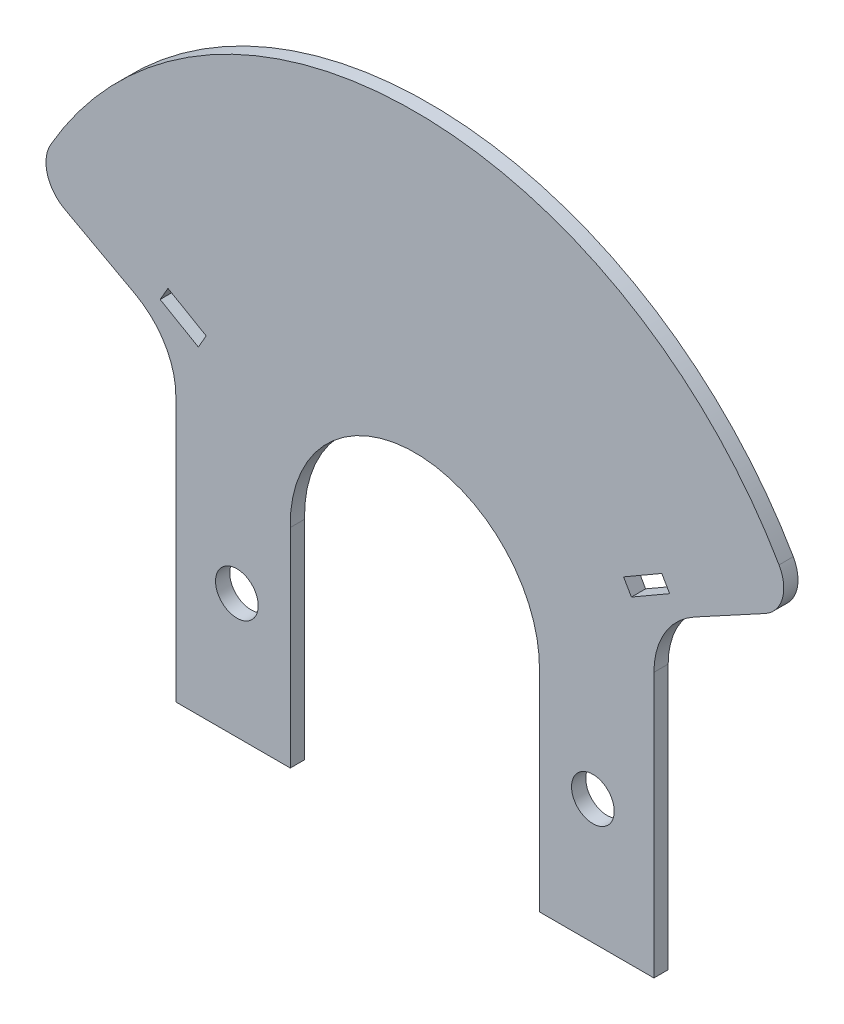
ISO-10303-21;
HEADER;
FILE_DESCRIPTION(('STEP AP214'),'2;1');
FILE_NAME('part.step','',(''),(''),'','','');
FILE_SCHEMA(('AUTOMOTIVE_DESIGN { 1 0 10303 214 1 1 1 1 }'));
ENDSEC;
DATA;
#1=APPLICATION_CONTEXT('core data for automotive mechanical design processes');
#2=APPLICATION_PROTOCOL_DEFINITION('international standard','automotive_design',2000,#1);
#3=PRODUCT_CONTEXT('',#1,'mechanical');
#4=PRODUCT('Part','Part','',(#3));
#5=PRODUCT_RELATED_PRODUCT_CATEGORY('part','',(#4));
#6=PRODUCT_DEFINITION_FORMATION('','',#4);
#7=PRODUCT_DEFINITION_CONTEXT('part definition',#1,'design');
#8=PRODUCT_DEFINITION('design','',#6,#7);
#9=PRODUCT_DEFINITION_SHAPE('','',#8);
#10=(LENGTH_UNIT() NAMED_UNIT(*) SI_UNIT(.MILLI.,.METRE.));
#11=(NAMED_UNIT(*) PLANE_ANGLE_UNIT() SI_UNIT($,.RADIAN.));
#12=(NAMED_UNIT(*) SI_UNIT($,.STERADIAN.) SOLID_ANGLE_UNIT());
#13=UNCERTAINTY_MEASURE_WITH_UNIT(LENGTH_MEASURE(1.E-05),#10,'distance_accuracy_value','');
#14=(GEOMETRIC_REPRESENTATION_CONTEXT(3) GLOBAL_UNCERTAINTY_ASSIGNED_CONTEXT((#13)) GLOBAL_UNIT_ASSIGNED_CONTEXT((#10,
#11,#12)) REPRESENTATION_CONTEXT('',''));
#15=CARTESIAN_POINT('',(0.,0.,0.));
#16=DIRECTION('',(0.,0.,1.));
#17=DIRECTION('',(1.,0.,0.));
#18=AXIS2_PLACEMENT_3D('',#15,#16,#17);
#19=CARTESIAN_POINT('',(44.466141388621,7.19165286363918,2.));
#20=DIRECTION('',(0.,0.,-1.));
#21=DIRECTION('',(-1.,0.,0.));
#22=AXIS2_PLACEMENT_3D('',#19,#20,#21);
#23=PLANE('',#22);
#24=DIRECTION('',(-0.5,-0.866025403784439,0.));
#25=VECTOR('',#24,1.);
#26=CARTESIAN_POINT('',(-34.6776186916967,19.7706159536035,2.));
#27=LINE('',#26,#25);
#28=CARTESIAN_POINT('',(-34.6776186916967,19.7706159536035,2.));
#29=VERTEX_POINT('',#28);
#30=CARTESIAN_POINT('',(-35.7776186916967,17.8653600652777,2.));
#31=VERTEX_POINT('',#30);
#32=EDGE_CURVE('E225',#29,#31,#27,.T.);
#33=ORIENTED_EDGE('',*,*,#32,.F.);
#34=DIRECTION('',(-0.866025403784439,0.499999999999999,0.));
#35=VECTOR('',#34,1.);
#36=CARTESIAN_POINT('',(-29.3082611882331,16.6706159536035,2.));
#37=LINE('',#36,#35);
#38=CARTESIAN_POINT('',(-29.3082611882331,16.6706159536035,2.));
#39=VERTEX_POINT('',#38);
#40=EDGE_CURVE('E233',#39,#29,#37,.T.);
#41=ORIENTED_EDGE('',*,*,#40,.F.);
#42=DIRECTION('',(0.5,0.866025403784438,0.));
#43=VECTOR('',#42,1.);
#44=CARTESIAN_POINT('',(-30.4082611882331,14.7653600652777,2.));
#45=LINE('',#44,#43);
#46=CARTESIAN_POINT('',(-30.4082611882331,14.7653600652777,2.));
#47=VERTEX_POINT('',#46);
#48=EDGE_CURVE('E230',#47,#39,#45,.T.);
#49=ORIENTED_EDGE('',*,*,#48,.F.);
#50=DIRECTION('',(0.866025403784439,-0.5,0.));
#51=VECTOR('',#50,1.);
#52=CARTESIAN_POINT('',(-35.7776186916967,17.8653600652777,2.));
#53=LINE('',#52,#51);
#54=EDGE_CURVE('E227',#31,#47,#53,.T.);
#55=ORIENTED_EDGE('',*,*,#54,.F.);
#56=EDGE_LOOP('',(#33,#41,#49,#55));
#57=FACE_BOUND('',#56,.T.);
#58=CARTESIAN_POINT('',(0.,-0.365986586774891,2.));
#59=DIRECTION('',(0.,0.,1.));
#60=DIRECTION('',(1.,0.,0.));
#61=AXIS2_PLACEMENT_3D('',#58,#59,#60);
#62=CIRCLE('',#61,58.993839611708);
#63=CARTESIAN_POINT('',(51.1418153623544,29.0412885942884,2.));
#64=VERTEX_POINT('',#63);
#65=CARTESIAN_POINT('',(-51.1418153623544,29.0412885942884,2.));
#66=VERTEX_POINT('',#65);
#67=EDGE_CURVE('E274',#64,#66,#62,.T.);
#68=ORIENTED_EDGE('',*,*,#67,.T.);
#69=CARTESIAN_POINT('',(-46.8073106327957,26.5488863897007,2.));
#70=DIRECTION('',(0.,0.,-1.));
#71=DIRECTION('',(-1.,0.,0.));
#72=AXIS2_PLACEMENT_3D('',#69,#70,#71);
#73=CIRCLE('',#72,5.);
#74=CARTESIAN_POINT('',(-49.1925604475212,22.1545055093773,2.));
#75=VERTEX_POINT('',#74);
#76=EDGE_CURVE('E41',#66,#75,#73,.F.);
#77=ORIENTED_EDGE('',*,*,#76,.T.);
#78=DIRECTION('',(0.878876176064681,-0.477049962945102,0.));
#79=VECTOR('',#78,1.);
#80=CARTESIAN_POINT('',(-39.2683210684572,16.7676738293564,2.));
#81=LINE('',#80,#79);
#82=CARTESIAN_POINT('',(-39.2683210684572,16.7676738293564,2.));
#83=VERTEX_POINT('',#82);
#84=EDGE_CURVE('E276',#75,#83,#81,.T.);
#85=ORIENTED_EDGE('',*,*,#84,.T.);
#86=CARTESIAN_POINT('',(-44.466141388621,7.19165286363915,2.));
#87=DIRECTION('',(0.,0.,-1.));
#88=DIRECTION('',(1.,0.,0.));
#89=AXIS2_PLACEMENT_3D('',#86,#87,#88);
#90=CIRCLE('',#89,10.8957566793942);
#91=CARTESIAN_POINT('',(-33.5703847092268,7.1916528636391,2.));
#92=VERTEX_POINT('',#91);
#93=EDGE_CURVE('E278',#83,#92,#90,.T.);
#94=ORIENTED_EDGE('',*,*,#93,.T.);
#95=DIRECTION('',(0.,-1.,0.));
#96=VECTOR('',#95,1.);
#97=CARTESIAN_POINT('',(-33.5703847092268,-29.9861237003492,2.));
#98=LINE('',#97,#96);
#99=CARTESIAN_POINT('',(-33.5703847092268,-29.9861237003492,2.));
#100=VERTEX_POINT('',#99);
#101=EDGE_CURVE('E280',#92,#100,#98,.T.);
#102=ORIENTED_EDGE('',*,*,#101,.T.);
#103=DIRECTION('',(1.,0.,0.));
#104=VECTOR('',#103,1.);
#105=CARTESIAN_POINT('',(-17.5,-29.9861237003492,2.));
#106=LINE('',#105,#104);
#107=CARTESIAN_POINT('',(-17.5,-29.9861237003492,2.));
#108=VERTEX_POINT('',#107);
#109=EDGE_CURVE('E282',#100,#108,#106,.T.);
#110=ORIENTED_EDGE('',*,*,#109,.T.);
#111=DIRECTION('',(0.,1.,0.));
#112=VECTOR('',#111,1.);
#113=CARTESIAN_POINT('',(-17.5,-0.731973173549668,2.));
#114=LINE('',#113,#112);
#115=CARTESIAN_POINT('',(-17.5,-0.731973173549653,2.));
#116=VERTEX_POINT('',#115);
#117=EDGE_CURVE('E284',#108,#116,#114,.T.);
#118=ORIENTED_EDGE('',*,*,#117,.T.);
#119=CARTESIAN_POINT('',(0.,-0.365986586774891,2.));
#120=DIRECTION('',(0.,0.,-1.));
#121=DIRECTION('',(1.,0.,0.));
#122=AXIS2_PLACEMENT_3D('',#119,#120,#121);
#123=CIRCLE('',#122,17.5038266153918);
#124=CARTESIAN_POINT('',(17.5,-0.731973173549668,2.));
#125=VERTEX_POINT('',#124);
#126=EDGE_CURVE('E286',#116,#125,#123,.T.);
#127=ORIENTED_EDGE('',*,*,#126,.T.);
#128=DIRECTION('',(0.,-1.,0.));
#129=VECTOR('',#128,1.);
#130=CARTESIAN_POINT('',(17.5,-0.731973173549668,2.));
#131=LINE('',#130,#129);
#132=CARTESIAN_POINT('',(17.5,-29.9861237003492,2.));
#133=VERTEX_POINT('',#132);
#134=EDGE_CURVE('E288',#125,#133,#131,.T.);
#135=ORIENTED_EDGE('',*,*,#134,.T.);
#136=DIRECTION('',(1.,0.,0.));
#137=VECTOR('',#136,1.);
#138=CARTESIAN_POINT('',(17.5,-29.9861237003492,2.));
#139=LINE('',#138,#137);
#140=CARTESIAN_POINT('',(33.5703847092268,-29.9861237003492,2.));
#141=VERTEX_POINT('',#140);
#142=EDGE_CURVE('E290',#133,#141,#139,.T.);
#143=ORIENTED_EDGE('',*,*,#142,.T.);
#144=DIRECTION('',(0.,1.,0.));
#145=VECTOR('',#144,1.);
#146=CARTESIAN_POINT('',(33.5703847092268,-29.9861237003492,2.));
#147=LINE('',#146,#145);
#148=CARTESIAN_POINT('',(33.5703847092268,7.19165286363912,2.));
#149=VERTEX_POINT('',#148);
#150=EDGE_CURVE('E292',#141,#149,#147,.T.);
#151=ORIENTED_EDGE('',*,*,#150,.T.);
#152=CARTESIAN_POINT('',(44.466141388621,7.19165286363918,2.));
#153=DIRECTION('',(0.,0.,-1.));
#154=DIRECTION('',(-1.,0.,0.));
#155=AXIS2_PLACEMENT_3D('',#152,#153,#154);
#156=CIRCLE('',#155,10.8957566793942);
#157=CARTESIAN_POINT('',(39.2683210684572,16.7676738293564,2.));
#158=VERTEX_POINT('',#157);
#159=EDGE_CURVE('E268',#149,#158,#156,.T.);
#160=ORIENTED_EDGE('',*,*,#159,.T.);
#161=DIRECTION('',(0.878876176064681,0.477049962945103,0.));
#162=VECTOR('',#161,1.);
#163=CARTESIAN_POINT('',(39.2683210684572,16.7676738293564,2.));
#164=LINE('',#163,#162);
#165=CARTESIAN_POINT('',(49.1925604475213,22.1545055093773,2.));
#166=VERTEX_POINT('',#165);
#167=EDGE_CURVE('E271',#158,#166,#164,.T.);
#168=ORIENTED_EDGE('',*,*,#167,.T.);
#169=CARTESIAN_POINT('',(46.8073106327957,26.5488863897007,2.));
#170=DIRECTION('',(0.,0.,-1.));
#171=DIRECTION('',(-1.,0.,0.));
#172=AXIS2_PLACEMENT_3D('',#169,#170,#171);
#173=CIRCLE('',#172,5.);
#174=EDGE_CURVE('E358',#166,#64,#173,.F.);
#175=ORIENTED_EDGE('',*,*,#174,.T.);
#176=EDGE_LOOP('',(#68,#77,#85,#94,#102,#110,#118,#127,#135,#143,#151,#160,#168,#175));
#177=FACE_BOUND('',#176,.T.);
#178=CARTESIAN_POINT('',(-25.,-12.5,2.));
#179=DIRECTION('',(0.,0.,1.));
#180=DIRECTION('',(1.,0.,0.));
#181=AXIS2_PLACEMENT_3D('',#178,#179,#180);
#182=CIRCLE('',#181,3.);
#183=CARTESIAN_POINT('',(-22.,-12.5,2.));
#184=VERTEX_POINT('',#183);
#185=EDGE_CURVE('E262',#184,#184,#182,.T.);
#186=ORIENTED_EDGE('',*,*,#185,.F.);
#187=EDGE_LOOP('',(#186));
#188=FACE_BOUND('',#187,.T.);
#189=CARTESIAN_POINT('',(25.,-12.5,2.));
#190=DIRECTION('',(0.,0.,1.));
#191=DIRECTION('',(-1.,0.,0.));
#192=AXIS2_PLACEMENT_3D('',#189,#190,#191);
#193=CIRCLE('',#192,3.);
#194=CARTESIAN_POINT('',(22.,-12.5,2.));
#195=VERTEX_POINT('',#194);
#196=EDGE_CURVE('E256',#195,#195,#193,.T.);
#197=ORIENTED_EDGE('',*,*,#196,.F.);
#198=EDGE_LOOP('',(#197));
#199=FACE_BOUND('',#198,.T.);
#200=DIRECTION('',(0.866025403784438,0.5,0.));
#201=VECTOR('',#200,1.);
#202=CARTESIAN_POINT('',(35.7776186918153,17.8653600652778,2.));
#203=LINE('',#202,#201);
#204=CARTESIAN_POINT('',(30.4082611883518,14.7653600652778,2.));
#205=VERTEX_POINT('',#204);
#206=CARTESIAN_POINT('',(35.7776186918153,17.8653600652778,2.));
#207=VERTEX_POINT('',#206);
#208=EDGE_CURVE('E184',#205,#207,#203,.T.);
#209=ORIENTED_EDGE('',*,*,#208,.F.);
#210=DIRECTION('',(0.5,-0.866025403784439,0.));
#211=VECTOR('',#210,1.);
#212=CARTESIAN_POINT('',(30.4082611883518,14.7653600652778,2.));
#213=LINE('',#212,#211);
#214=CARTESIAN_POINT('',(29.3082611883518,16.6706159536035,2.));
#215=VERTEX_POINT('',#214);
#216=EDGE_CURVE('E209',#215,#205,#213,.T.);
#217=ORIENTED_EDGE('',*,*,#216,.F.);
#218=DIRECTION('',(-0.866025403784439,-0.5,0.));
#219=VECTOR('',#218,1.);
#220=CARTESIAN_POINT('',(29.3082611883518,16.6706159536035,2.));
#221=LINE('',#220,#219);
#222=CARTESIAN_POINT('',(34.6776186918153,19.7706159536035,2.));
#223=VERTEX_POINT('',#222);
#224=EDGE_CURVE('E207',#223,#215,#221,.T.);
#225=ORIENTED_EDGE('',*,*,#224,.F.);
#226=DIRECTION('',(-0.500000000000001,0.866025403784438,0.));
#227=VECTOR('',#226,1.);
#228=CARTESIAN_POINT('',(34.6776186918153,19.7706159536035,2.));
#229=LINE('',#228,#227);
#230=EDGE_CURVE('E194',#207,#223,#229,.T.);
#231=ORIENTED_EDGE('',*,*,#230,.F.);
#232=EDGE_LOOP('',(#209,#217,#225,#231));
#233=FACE_BOUND('',#232,.T.);
#234=ADVANCED_FACE('F33',(#57,#177,#188,#199,#233),#23,.F.);
#235=CARTESIAN_POINT('',(44.466141388621,7.19165286363918,0.));
#236=DIRECTION('',(0.,0.,-1.));
#237=DIRECTION('',(-1.,0.,0.));
#238=AXIS2_PLACEMENT_3D('',#235,#236,#237);
#239=PLANE('',#238);
#240=CARTESIAN_POINT('',(-25.,-12.5,0.));
#241=DIRECTION('',(0.,0.,1.));
#242=DIRECTION('',(1.,0.,0.));
#243=AXIS2_PLACEMENT_3D('',#240,#241,#242);
#244=CIRCLE('',#243,3.);
#245=CARTESIAN_POINT('',(-22.,-12.5,0.));
#246=VERTEX_POINT('',#245);
#247=EDGE_CURVE('E259',#246,#246,#244,.T.);
#248=ORIENTED_EDGE('',*,*,#247,.T.);
#249=EDGE_LOOP('',(#248));
#250=FACE_BOUND('',#249,.T.);
#251=DIRECTION('',(0.878876176064681,-0.477049962945102,0.));
#252=VECTOR('',#251,1.);
#253=CARTESIAN_POINT('',(-39.2683210684572,16.7676738293564,0.));
#254=LINE('',#253,#252);
#255=CARTESIAN_POINT('',(-49.1925604475212,22.1545055093773,0.));
#256=VERTEX_POINT('',#255);
#257=CARTESIAN_POINT('',(-39.2683210684572,16.7676738293564,0.));
#258=VERTEX_POINT('',#257);
#259=EDGE_CURVE('E301',#256,#258,#254,.T.);
#260=ORIENTED_EDGE('',*,*,#259,.F.);
#261=CARTESIAN_POINT('',(-46.8073106327957,26.5488863897007,0.));
#262=DIRECTION('',(0.,0.,-1.));
#263=DIRECTION('',(-1.,0.,0.));
#264=AXIS2_PLACEMENT_3D('',#261,#262,#263);
#265=CIRCLE('',#264,5.);
#266=CARTESIAN_POINT('',(-51.1418153623544,29.0412885942884,0.));
#267=VERTEX_POINT('',#266);
#268=EDGE_CURVE('E352',#256,#267,#265,.T.);
#269=ORIENTED_EDGE('',*,*,#268,.T.);
#270=CARTESIAN_POINT('',(0.,-0.365986586774891,0.));
#271=DIRECTION('',(0.,0.,1.));
#272=DIRECTION('',(1.,0.,0.));
#273=AXIS2_PLACEMENT_3D('',#270,#271,#272);
#274=CIRCLE('',#273,58.993839611708);
#275=CARTESIAN_POINT('',(51.1418153623544,29.0412885942884,0.));
#276=VERTEX_POINT('',#275);
#277=EDGE_CURVE('E299',#276,#267,#274,.T.);
#278=ORIENTED_EDGE('',*,*,#277,.F.);
#279=CARTESIAN_POINT('',(46.8073106327957,26.5488863897007,0.));
#280=DIRECTION('',(0.,0.,-1.));
#281=DIRECTION('',(-1.,0.,0.));
#282=AXIS2_PLACEMENT_3D('',#279,#280,#281);
#283=CIRCLE('',#282,5.);
#284=CARTESIAN_POINT('',(49.1925604475213,22.1545055093773,0.));
#285=VERTEX_POINT('',#284);
#286=EDGE_CURVE('E350',#276,#285,#283,.T.);
#287=ORIENTED_EDGE('',*,*,#286,.T.);
#288=DIRECTION('',(0.878876176064681,0.477049962945103,0.));
#289=VECTOR('',#288,1.);
#290=CARTESIAN_POINT('',(39.2683210684572,16.7676738293564,0.));
#291=LINE('',#290,#289);
#292=CARTESIAN_POINT('',(39.2683210684572,16.7676738293564,0.));
#293=VERTEX_POINT('',#292);
#294=EDGE_CURVE('E297',#293,#285,#291,.T.);
#295=ORIENTED_EDGE('',*,*,#294,.F.);
#296=CARTESIAN_POINT('',(44.466141388621,7.19165286363918,0.));
#297=DIRECTION('',(0.,0.,-1.));
#298=DIRECTION('',(-1.,0.,0.));
#299=AXIS2_PLACEMENT_3D('',#296,#297,#298);
#300=CIRCLE('',#299,10.8957566793942);
#301=CARTESIAN_POINT('',(33.5703847092268,7.19165286363912,0.));
#302=VERTEX_POINT('',#301);
#303=EDGE_CURVE('E265',#302,#293,#300,.T.);
#304=ORIENTED_EDGE('',*,*,#303,.F.);
#305=DIRECTION('',(0.,1.,0.));
#306=VECTOR('',#305,1.);
#307=CARTESIAN_POINT('',(33.5703847092268,-29.9861237003492,0.));
#308=LINE('',#307,#306);
#309=CARTESIAN_POINT('',(33.5703847092268,-29.9861237003492,0.));
#310=VERTEX_POINT('',#309);
#311=EDGE_CURVE('E272',#310,#302,#308,.T.);
#312=ORIENTED_EDGE('',*,*,#311,.F.);
#313=DIRECTION('',(1.,0.,0.));
#314=VECTOR('',#313,1.);
#315=CARTESIAN_POINT('',(17.5,-29.9861237003492,0.));
#316=LINE('',#315,#314);
#317=CARTESIAN_POINT('',(17.5,-29.9861237003492,0.));
#318=VERTEX_POINT('',#317);
#319=EDGE_CURVE('E315',#318,#310,#316,.T.);
#320=ORIENTED_EDGE('',*,*,#319,.F.);
#321=DIRECTION('',(0.,-1.,0.));
#322=VECTOR('',#321,1.);
#323=CARTESIAN_POINT('',(17.5,-0.731973173549668,0.));
#324=LINE('',#323,#322);
#325=CARTESIAN_POINT('',(17.5,-0.731973173549668,0.));
#326=VERTEX_POINT('',#325);
#327=EDGE_CURVE('E313',#326,#318,#324,.T.);
#328=ORIENTED_EDGE('',*,*,#327,.F.);
#329=CARTESIAN_POINT('',(0.,-0.365986586774891,0.));
#330=DIRECTION('',(0.,0.,-1.));
#331=DIRECTION('',(1.,0.,0.));
#332=AXIS2_PLACEMENT_3D('',#329,#330,#331);
#333=CIRCLE('',#332,17.5038266153918);
#334=CARTESIAN_POINT('',(-17.5,-0.731973173549653,0.));
#335=VERTEX_POINT('',#334);
#336=EDGE_CURVE('E311',#335,#326,#333,.T.);
#337=ORIENTED_EDGE('',*,*,#336,.F.);
#338=DIRECTION('',(0.,1.,0.));
#339=VECTOR('',#338,1.);
#340=CARTESIAN_POINT('',(-17.5,-0.731973173549668,0.));
#341=LINE('',#340,#339);
#342=CARTESIAN_POINT('',(-17.5,-29.9861237003492,0.));
#343=VERTEX_POINT('',#342);
#344=EDGE_CURVE('E309',#343,#335,#341,.T.);
#345=ORIENTED_EDGE('',*,*,#344,.F.);
#346=DIRECTION('',(1.,0.,0.));
#347=VECTOR('',#346,1.);
#348=CARTESIAN_POINT('',(-17.5,-29.9861237003492,0.));
#349=LINE('',#348,#347);
#350=CARTESIAN_POINT('',(-33.5703847092268,-29.9861237003492,0.));
#351=VERTEX_POINT('',#350);
#352=EDGE_CURVE('E307',#351,#343,#349,.T.);
#353=ORIENTED_EDGE('',*,*,#352,.F.);
#354=DIRECTION('',(0.,-1.,0.));
#355=VECTOR('',#354,1.);
#356=CARTESIAN_POINT('',(-33.5703847092268,-29.9861237003492,0.));
#357=LINE('',#356,#355);
#358=CARTESIAN_POINT('',(-33.5703847092268,7.1916528636391,0.));
#359=VERTEX_POINT('',#358);
#360=EDGE_CURVE('E305',#359,#351,#357,.T.);
#361=ORIENTED_EDGE('',*,*,#360,.F.);
#362=CARTESIAN_POINT('',(-44.466141388621,7.19165286363915,0.));
#363=DIRECTION('',(0.,0.,-1.));
#364=DIRECTION('',(1.,0.,0.));
#365=AXIS2_PLACEMENT_3D('',#362,#363,#364);
#366=CIRCLE('',#365,10.8957566793942);
#367=EDGE_CURVE('E303',#258,#359,#366,.T.);
#368=ORIENTED_EDGE('',*,*,#367,.F.);
#369=EDGE_LOOP('',(#260,#269,#278,#287,#295,#304,#312,#320,#328,#337,#345,#353,#361,#368));
#370=FACE_BOUND('',#369,.T.);
#371=CARTESIAN_POINT('',(25.,-12.5,0.));
#372=DIRECTION('',(0.,0.,1.));
#373=DIRECTION('',(-1.,0.,0.));
#374=AXIS2_PLACEMENT_3D('',#371,#372,#373);
#375=CIRCLE('',#374,3.);
#376=CARTESIAN_POINT('',(22.,-12.5,0.));
#377=VERTEX_POINT('',#376);
#378=EDGE_CURVE('E255',#377,#377,#375,.T.);
#379=ORIENTED_EDGE('',*,*,#378,.T.);
#380=EDGE_LOOP('',(#379));
#381=FACE_BOUND('',#380,.T.);
#382=DIRECTION('',(-0.866025403784439,0.499999999999999,0.));
#383=VECTOR('',#382,1.);
#384=CARTESIAN_POINT('',(-29.3082611882331,16.6706159536035,0.));
#385=LINE('',#384,#383);
#386=CARTESIAN_POINT('',(-29.3082611882331,16.6706159536035,0.));
#387=VERTEX_POINT('',#386);
#388=CARTESIAN_POINT('',(-34.6776186916967,19.7706159536035,0.));
#389=VERTEX_POINT('',#388);
#390=EDGE_CURVE('E228',#387,#389,#385,.T.);
#391=ORIENTED_EDGE('',*,*,#390,.T.);
#392=DIRECTION('',(-0.5,-0.866025403784439,0.));
#393=VECTOR('',#392,1.);
#394=CARTESIAN_POINT('',(-34.6776186916967,19.7706159536035,0.));
#395=LINE('',#394,#393);
#396=CARTESIAN_POINT('',(-35.7776186916967,17.8653600652777,0.));
#397=VERTEX_POINT('',#396);
#398=EDGE_CURVE('E202',#389,#397,#395,.T.);
#399=ORIENTED_EDGE('',*,*,#398,.T.);
#400=DIRECTION('',(0.866025403784439,-0.5,0.));
#401=VECTOR('',#400,1.);
#402=CARTESIAN_POINT('',(-35.7776186916967,17.8653600652777,0.));
#403=LINE('',#402,#401);
#404=CARTESIAN_POINT('',(-30.4082611882331,14.7653600652777,0.));
#405=VERTEX_POINT('',#404);
#406=EDGE_CURVE('E238',#397,#405,#403,.T.);
#407=ORIENTED_EDGE('',*,*,#406,.T.);
#408=DIRECTION('',(0.5,0.866025403784438,0.));
#409=VECTOR('',#408,1.);
#410=CARTESIAN_POINT('',(-30.4082611882331,14.7653600652777,0.));
#411=LINE('',#410,#409);
#412=EDGE_CURVE('E241',#405,#387,#411,.T.);
#413=ORIENTED_EDGE('',*,*,#412,.T.);
#414=EDGE_LOOP('',(#391,#399,#407,#413));
#415=FACE_BOUND('',#414,.T.);
#416=DIRECTION('',(0.5,-0.866025403784439,0.));
#417=VECTOR('',#416,1.);
#418=CARTESIAN_POINT('',(30.4082611883518,14.7653600652778,0.));
#419=LINE('',#418,#417);
#420=CARTESIAN_POINT('',(29.3082611883518,16.6706159536035,0.));
#421=VERTEX_POINT('',#420);
#422=CARTESIAN_POINT('',(30.4082611883518,14.7653600652778,0.));
#423=VERTEX_POINT('',#422);
#424=EDGE_CURVE('E195',#421,#423,#419,.T.);
#425=ORIENTED_EDGE('',*,*,#424,.T.);
#426=DIRECTION('',(0.866025403784438,0.5,0.));
#427=VECTOR('',#426,1.);
#428=CARTESIAN_POINT('',(35.7776186918153,17.8653600652778,0.));
#429=LINE('',#428,#427);
#430=CARTESIAN_POINT('',(35.7776186918153,17.8653600652778,0.));
#431=VERTEX_POINT('',#430);
#432=EDGE_CURVE('E213',#423,#431,#429,.T.);
#433=ORIENTED_EDGE('',*,*,#432,.T.);
#434=DIRECTION('',(-0.500000000000001,0.866025403784438,0.));
#435=VECTOR('',#434,1.);
#436=CARTESIAN_POINT('',(34.6776186918153,19.7706159536035,0.));
#437=LINE('',#436,#435);
#438=CARTESIAN_POINT('',(34.6776186918153,19.7706159536035,0.));
#439=VERTEX_POINT('',#438);
#440=EDGE_CURVE('E201',#431,#439,#437,.T.);
#441=ORIENTED_EDGE('',*,*,#440,.T.);
#442=DIRECTION('',(-0.866025403784439,-0.5,0.));
#443=VECTOR('',#442,1.);
#444=CARTESIAN_POINT('',(29.3082611883518,16.6706159536035,0.));
#445=LINE('',#444,#443);
#446=EDGE_CURVE('E216',#439,#421,#445,.T.);
#447=ORIENTED_EDGE('',*,*,#446,.T.);
#448=EDGE_LOOP('',(#425,#433,#441,#447));
#449=FACE_BOUND('',#448,.T.);
#450=ADVANCED_FACE('F373',(#250,#370,#381,#415,#449),#239,.T.);
#451=CARTESIAN_POINT('',(44.466141388621,7.19165286363918,2.));
#452=DIRECTION('',(0.,0.,-1.));
#453=DIRECTION('',(-1.,0.,0.));
#454=AXIS2_PLACEMENT_3D('',#451,#452,#453);
#455=CYLINDRICAL_SURFACE('',#454,10.8957566793942);
#456=ORIENTED_EDGE('',*,*,#303,.T.);
#457=DIRECTION('',(0.,0.,-1.));
#458=VECTOR('',#457,1.);
#459=CARTESIAN_POINT('',(39.2683210684572,16.7676738293564,2.));
#460=LINE('',#459,#458);
#461=EDGE_CURVE('E344',#158,#293,#460,.T.);
#462=ORIENTED_EDGE('',*,*,#461,.F.);
#463=ORIENTED_EDGE('',*,*,#159,.F.);
#464=DIRECTION('',(0.,0.,-1.));
#465=VECTOR('',#464,1.);
#466=CARTESIAN_POINT('',(33.5703847092268,7.19165286363912,2.));
#467=LINE('',#466,#465);
#468=EDGE_CURVE('E294',#149,#302,#467,.T.);
#469=ORIENTED_EDGE('',*,*,#468,.T.);
#470=EDGE_LOOP('',(#456,#462,#463,#469));
#471=FACE_BOUND('',#470,.T.);
#472=ADVANCED_FACE('F385',(#471),#455,.F.);
#473=CARTESIAN_POINT('',(39.2683210684572,16.7676738293564,2.));
#474=DIRECTION('',(-0.477049962945103,0.878876176064681,0.));
#475=DIRECTION('',(-0.878876176064681,-0.477049962945103,0.));
#476=AXIS2_PLACEMENT_3D('',#473,#474,#475);
#477=PLANE('',#476);
#478=ORIENTED_EDGE('',*,*,#294,.T.);
#479=DIRECTION('',(0.,0.,-1.));
#480=VECTOR('',#479,1.);
#481=CARTESIAN_POINT('',(49.1925604475213,22.1545055093773,2.));
#482=LINE('',#481,#480);
#483=EDGE_CURVE('E11',#285,#166,#482,.F.);
#484=ORIENTED_EDGE('',*,*,#483,.T.);
#485=ORIENTED_EDGE('',*,*,#167,.F.);
#486=ORIENTED_EDGE('',*,*,#461,.T.);
#487=EDGE_LOOP('',(#478,#484,#485,#486));
#488=FACE_BOUND('',#487,.T.);
#489=ADVANCED_FACE('F381',(#488),#477,.F.);
#490=CARTESIAN_POINT('',(0.,-0.365986586774891,2.));
#491=DIRECTION('',(0.,0.,-1.));
#492=DIRECTION('',(-1.,0.,0.));
#493=AXIS2_PLACEMENT_3D('',#490,#491,#492);
#494=CYLINDRICAL_SURFACE('',#493,58.993839611708);
#495=ORIENTED_EDGE('',*,*,#277,.T.);
#496=DIRECTION('',(0.,0.,-1.));
#497=VECTOR('',#496,1.);
#498=CARTESIAN_POINT('',(-51.1418153623544,29.0412885942884,2.));
#499=LINE('',#498,#497);
#500=EDGE_CURVE('E54',#267,#66,#499,.F.);
#501=ORIENTED_EDGE('',*,*,#500,.T.);
#502=ORIENTED_EDGE('',*,*,#67,.F.);
#503=DIRECTION('',(0.,0.,-1.));
#504=VECTOR('',#503,1.);
#505=CARTESIAN_POINT('',(51.1418153623544,29.0412885942884,2.));
#506=LINE('',#505,#504);
#507=EDGE_CURVE('E354',#64,#276,#506,.T.);
#508=ORIENTED_EDGE('',*,*,#507,.T.);
#509=EDGE_LOOP('',(#495,#501,#502,#508));
#510=FACE_BOUND('',#509,.T.);
#511=ADVANCED_FACE('F376',(#510),#494,.T.);
#512=CARTESIAN_POINT('',(-39.2683210684572,16.7676738293564,2.));
#513=DIRECTION('',(0.477049962945102,0.878876176064681,0.));
#514=DIRECTION('',(-0.878876176064681,0.477049962945102,0.));
#515=AXIS2_PLACEMENT_3D('',#512,#513,#514);
#516=PLANE('',#515);
#517=ORIENTED_EDGE('',*,*,#84,.F.);
#518=DIRECTION('',(0.,0.,-1.));
#519=VECTOR('',#518,1.);
#520=CARTESIAN_POINT('',(-49.1925604475212,22.1545055093773,2.));
#521=LINE('',#520,#519);
#522=EDGE_CURVE('E347',#75,#256,#521,.T.);
#523=ORIENTED_EDGE('',*,*,#522,.T.);
#524=ORIENTED_EDGE('',*,*,#259,.T.);
#525=DIRECTION('',(0.,0.,-1.));
#526=VECTOR('',#525,1.);
#527=CARTESIAN_POINT('',(-39.2683210684572,16.7676738293564,2.));
#528=LINE('',#527,#526);
#529=EDGE_CURVE('E341',#83,#258,#528,.T.);
#530=ORIENTED_EDGE('',*,*,#529,.F.);
#531=EDGE_LOOP('',(#517,#523,#524,#530));
#532=FACE_BOUND('',#531,.T.);
#533=ADVANCED_FACE('F367',(#532),#516,.F.);
#534=CARTESIAN_POINT('',(-44.466141388621,7.19165286363915,2.));
#535=DIRECTION('',(0.,0.,-1.));
#536=DIRECTION('',(-1.,0.,0.));
#537=AXIS2_PLACEMENT_3D('',#534,#535,#536);
#538=CYLINDRICAL_SURFACE('',#537,10.8957566793942);
#539=ORIENTED_EDGE('',*,*,#367,.T.);
#540=DIRECTION('',(0.,0.,-1.));
#541=VECTOR('',#540,1.);
#542=CARTESIAN_POINT('',(-33.5703847092268,7.1916528636391,2.));
#543=LINE('',#542,#541);
#544=EDGE_CURVE('E338',#92,#359,#543,.T.);
#545=ORIENTED_EDGE('',*,*,#544,.F.);
#546=ORIENTED_EDGE('',*,*,#93,.F.);
#547=ORIENTED_EDGE('',*,*,#529,.T.);
#548=EDGE_LOOP('',(#539,#545,#546,#547));
#549=FACE_BOUND('',#548,.T.);
#550=ADVANCED_FACE('F423',(#549),#538,.F.);
#551=CARTESIAN_POINT('',(-33.5703847092268,-29.9861237003492,2.));
#552=DIRECTION('',(1.,0.,0.));
#553=DIRECTION('',(0.,0.,-1.));
#554=AXIS2_PLACEMENT_3D('',#551,#552,#553);
#555=PLANE('',#554);
#556=ORIENTED_EDGE('',*,*,#360,.T.);
#557=DIRECTION('',(0.,0.,-1.));
#558=VECTOR('',#557,1.);
#559=CARTESIAN_POINT('',(-33.5703847092268,-29.9861237003492,2.));
#560=LINE('',#559,#558);
#561=EDGE_CURVE('E335',#100,#351,#560,.T.);
#562=ORIENTED_EDGE('',*,*,#561,.F.);
#563=ORIENTED_EDGE('',*,*,#101,.F.);
#564=ORIENTED_EDGE('',*,*,#544,.T.);
#565=EDGE_LOOP('',(#556,#562,#563,#564));
#566=FACE_BOUND('',#565,.T.);
#567=ADVANCED_FACE('F419',(#566),#555,.F.);
#568=CARTESIAN_POINT('',(-17.5,-29.9861237003492,2.));
#569=DIRECTION('',(0.,1.,0.));
#570=DIRECTION('',(-1.,0.,0.));
#571=AXIS2_PLACEMENT_3D('',#568,#569,#570);
#572=PLANE('',#571);
#573=ORIENTED_EDGE('',*,*,#352,.T.);
#574=DIRECTION('',(0.,0.,-1.));
#575=VECTOR('',#574,1.);
#576=CARTESIAN_POINT('',(-17.5,-29.9861237003492,2.));
#577=LINE('',#576,#575);
#578=EDGE_CURVE('E332',#108,#343,#577,.T.);
#579=ORIENTED_EDGE('',*,*,#578,.F.);
#580=ORIENTED_EDGE('',*,*,#109,.F.);
#581=ORIENTED_EDGE('',*,*,#561,.T.);
#582=EDGE_LOOP('',(#573,#579,#580,#581));
#583=FACE_BOUND('',#582,.T.);
#584=ADVANCED_FACE('F415',(#583),#572,.F.);
#585=CARTESIAN_POINT('',(-17.5,-0.731973173549668,2.));
#586=DIRECTION('',(-1.,0.,0.));
#587=DIRECTION('',(0.,0.,1.));
#588=AXIS2_PLACEMENT_3D('',#585,#586,#587);
#589=PLANE('',#588);
#590=ORIENTED_EDGE('',*,*,#344,.T.);
#591=DIRECTION('',(0.,0.,-1.));
#592=VECTOR('',#591,1.);
#593=CARTESIAN_POINT('',(-17.5,-0.731973173549653,2.));
#594=LINE('',#593,#592);
#595=EDGE_CURVE('E329',#116,#335,#594,.T.);
#596=ORIENTED_EDGE('',*,*,#595,.F.);
#597=ORIENTED_EDGE('',*,*,#117,.F.);
#598=ORIENTED_EDGE('',*,*,#578,.T.);
#599=EDGE_LOOP('',(#590,#596,#597,#598));
#600=FACE_BOUND('',#599,.T.);
#601=ADVANCED_FACE('F411',(#600),#589,.F.);
#602=CARTESIAN_POINT('',(0.,-0.365986586774891,2.));
#603=DIRECTION('',(0.,0.,-1.));
#604=DIRECTION('',(-1.,0.,0.));
#605=AXIS2_PLACEMENT_3D('',#602,#603,#604);
#606=CYLINDRICAL_SURFACE('',#605,17.5038266153918);
#607=ORIENTED_EDGE('',*,*,#336,.T.);
#608=DIRECTION('',(0.,0.,-1.));
#609=VECTOR('',#608,1.);
#610=CARTESIAN_POINT('',(17.5,-0.731973173549668,2.));
#611=LINE('',#610,#609);
#612=EDGE_CURVE('E326',#125,#326,#611,.T.);
#613=ORIENTED_EDGE('',*,*,#612,.F.);
#614=ORIENTED_EDGE('',*,*,#126,.F.);
#615=ORIENTED_EDGE('',*,*,#595,.T.);
#616=EDGE_LOOP('',(#607,#613,#614,#615));
#617=FACE_BOUND('',#616,.T.);
#618=ADVANCED_FACE('F406',(#617),#606,.F.);
#619=CARTESIAN_POINT('',(17.5,-0.731973173549668,2.));
#620=DIRECTION('',(1.,0.,0.));
#621=DIRECTION('',(0.,0.,-1.));
#622=AXIS2_PLACEMENT_3D('',#619,#620,#621);
#623=PLANE('',#622);
#624=ORIENTED_EDGE('',*,*,#327,.T.);
#625=DIRECTION('',(0.,0.,-1.));
#626=VECTOR('',#625,1.);
#627=CARTESIAN_POINT('',(17.5,-29.9861237003492,2.));
#628=LINE('',#627,#626);
#629=EDGE_CURVE('E323',#133,#318,#628,.T.);
#630=ORIENTED_EDGE('',*,*,#629,.F.);
#631=ORIENTED_EDGE('',*,*,#134,.F.);
#632=ORIENTED_EDGE('',*,*,#612,.T.);
#633=EDGE_LOOP('',(#624,#630,#631,#632));
#634=FACE_BOUND('',#633,.T.);
#635=ADVANCED_FACE('F400',(#634),#623,.F.);
#636=CARTESIAN_POINT('',(17.5,-29.9861237003492,2.));
#637=DIRECTION('',(0.,1.,0.));
#638=DIRECTION('',(-1.,0.,0.));
#639=AXIS2_PLACEMENT_3D('',#636,#637,#638);
#640=PLANE('',#639);
#641=ORIENTED_EDGE('',*,*,#319,.T.);
#642=DIRECTION('',(0.,0.,-1.));
#643=VECTOR('',#642,1.);
#644=CARTESIAN_POINT('',(33.5703847092268,-29.9861237003492,2.));
#645=LINE('',#644,#643);
#646=EDGE_CURVE('E320',#141,#310,#645,.T.);
#647=ORIENTED_EDGE('',*,*,#646,.F.);
#648=ORIENTED_EDGE('',*,*,#142,.F.);
#649=ORIENTED_EDGE('',*,*,#629,.T.);
#650=EDGE_LOOP('',(#641,#647,#648,#649));
#651=FACE_BOUND('',#650,.T.);
#652=ADVANCED_FACE('F396',(#651),#640,.F.);
#653=CARTESIAN_POINT('',(33.5703847092268,-29.9861237003492,2.));
#654=DIRECTION('',(-1.,0.,0.));
#655=DIRECTION('',(0.,-1.,0.));
#656=AXIS2_PLACEMENT_3D('',#653,#654,#655);
#657=PLANE('',#656);
#658=ORIENTED_EDGE('',*,*,#311,.T.);
#659=ORIENTED_EDGE('',*,*,#468,.F.);
#660=ORIENTED_EDGE('',*,*,#150,.F.);
#661=ORIENTED_EDGE('',*,*,#646,.T.);
#662=EDGE_LOOP('',(#658,#659,#660,#661));
#663=FACE_BOUND('',#662,.T.);
#664=ADVANCED_FACE('F391',(#663),#657,.F.);
#665=CARTESIAN_POINT('',(-25.,-12.5,2.));
#666=DIRECTION('',(0.,0.,-1.));
#667=DIRECTION('',(-1.,0.,0.));
#668=AXIS2_PLACEMENT_3D('',#665,#666,#667);
#669=CYLINDRICAL_SURFACE('',#668,3.);
#670=ORIENTED_EDGE('',*,*,#185,.T.);
#671=EDGE_LOOP('',(#670));
#672=FACE_BOUND('',#671,.T.);
#673=ORIENTED_EDGE('',*,*,#247,.F.);
#674=EDGE_LOOP('',(#673));
#675=FACE_BOUND('',#674,.T.);
#676=ADVANCED_FACE('F442',(#672,#675),#669,.F.);
#677=CARTESIAN_POINT('',(25.,-12.5,2.));
#678=DIRECTION('',(0.,0.,-1.));
#679=DIRECTION('',(-1.,0.,0.));
#680=AXIS2_PLACEMENT_3D('',#677,#678,#679);
#681=CYLINDRICAL_SURFACE('',#680,3.);
#682=ORIENTED_EDGE('',*,*,#196,.T.);
#683=EDGE_LOOP('',(#682));
#684=FACE_BOUND('',#683,.T.);
#685=ORIENTED_EDGE('',*,*,#378,.F.);
#686=EDGE_LOOP('',(#685));
#687=FACE_BOUND('',#686,.T.);
#688=ADVANCED_FACE('F486',(#684,#687),#681,.F.);
#689=CARTESIAN_POINT('',(-34.6776186916967,19.7706159536035,2.));
#690=DIRECTION('',(0.866025403784439,-0.5,0.));
#691=DIRECTION('',(0.5,0.866025403784439,0.));
#692=AXIS2_PLACEMENT_3D('',#689,#690,#691);
#693=PLANE('',#692);
#694=ORIENTED_EDGE('',*,*,#398,.F.);
#695=DIRECTION('',(0.,0.,-1.));
#696=VECTOR('',#695,1.);
#697=CARTESIAN_POINT('',(-34.6776186916967,19.7706159536035,2.));
#698=LINE('',#697,#696);
#699=EDGE_CURVE('E235',#29,#389,#698,.T.);
#700=ORIENTED_EDGE('',*,*,#699,.F.);
#701=ORIENTED_EDGE('',*,*,#32,.T.);
#702=DIRECTION('',(0.,0.,-1.));
#703=VECTOR('',#702,1.);
#704=CARTESIAN_POINT('',(-35.7776186916967,17.8653600652777,2.));
#705=LINE('',#704,#703);
#706=EDGE_CURVE('E252',#31,#397,#705,.T.);
#707=ORIENTED_EDGE('',*,*,#706,.T.);
#708=EDGE_LOOP('',(#694,#700,#701,#707));
#709=FACE_BOUND('',#708,.T.);
#710=ADVANCED_FACE('F493',(#709),#693,.T.);
#711=CARTESIAN_POINT('',(-35.7776186916967,17.8653600652777,2.));
#712=DIRECTION('',(0.5,0.866025403784439,0.));
#713=DIRECTION('',(-0.866025403784439,0.5,0.));
#714=AXIS2_PLACEMENT_3D('',#711,#712,#713);
#715=PLANE('',#714);
#716=ORIENTED_EDGE('',*,*,#406,.F.);
#717=ORIENTED_EDGE('',*,*,#706,.F.);
#718=ORIENTED_EDGE('',*,*,#54,.T.);
#719=DIRECTION('',(0.,0.,-1.));
#720=VECTOR('',#719,1.);
#721=CARTESIAN_POINT('',(-30.4082611882331,14.7653600652777,2.));
#722=LINE('',#721,#720);
#723=EDGE_CURVE('E250',#47,#405,#722,.T.);
#724=ORIENTED_EDGE('',*,*,#723,.T.);
#725=EDGE_LOOP('',(#716,#717,#718,#724));
#726=FACE_BOUND('',#725,.T.);
#727=ADVANCED_FACE('F500',(#726),#715,.T.);
#728=CARTESIAN_POINT('',(-30.4082611882331,14.7653600652777,2.));
#729=DIRECTION('',(-0.866025403784438,0.5,0.));
#730=DIRECTION('',(-0.5,-0.866025403784438,0.));
#731=AXIS2_PLACEMENT_3D('',#728,#729,#730);
#732=PLANE('',#731);
#733=ORIENTED_EDGE('',*,*,#412,.F.);
#734=ORIENTED_EDGE('',*,*,#723,.F.);
#735=ORIENTED_EDGE('',*,*,#48,.T.);
#736=DIRECTION('',(0.,0.,-1.));
#737=VECTOR('',#736,1.);
#738=CARTESIAN_POINT('',(-29.3082611882331,16.6706159536035,2.));
#739=LINE('',#738,#737);
#740=EDGE_CURVE('E248',#39,#387,#739,.T.);
#741=ORIENTED_EDGE('',*,*,#740,.T.);
#742=EDGE_LOOP('',(#733,#734,#735,#741));
#743=FACE_BOUND('',#742,.T.);
#744=ADVANCED_FACE('F508',(#743),#732,.T.);
#745=CARTESIAN_POINT('',(-29.3082611882331,16.6706159536035,2.));
#746=DIRECTION('',(-0.499999999999999,-0.866025403784439,0.));
#747=DIRECTION('',(0.866025403784439,-0.5,0.));
#748=AXIS2_PLACEMENT_3D('',#745,#746,#747);
#749=PLANE('',#748);
#750=ORIENTED_EDGE('',*,*,#390,.F.);
#751=ORIENTED_EDGE('',*,*,#740,.F.);
#752=ORIENTED_EDGE('',*,*,#40,.T.);
#753=ORIENTED_EDGE('',*,*,#699,.T.);
#754=EDGE_LOOP('',(#750,#751,#752,#753));
#755=FACE_BOUND('',#754,.T.);
#756=ADVANCED_FACE('F516',(#755),#749,.T.);
#757=CARTESIAN_POINT('',(35.7776186918153,17.8653600652778,2.));
#758=DIRECTION('',(-0.5,0.866025403784439,0.));
#759=DIRECTION('',(-0.866025403784439,-0.5,0.));
#760=AXIS2_PLACEMENT_3D('',#757,#758,#759);
#761=PLANE('',#760);
#762=ORIENTED_EDGE('',*,*,#432,.F.);
#763=DIRECTION('',(0.,0.,-1.));
#764=VECTOR('',#763,1.);
#765=CARTESIAN_POINT('',(30.4082611883518,14.7653600652778,2.));
#766=LINE('',#765,#764);
#767=EDGE_CURVE('E190',#205,#423,#766,.T.);
#768=ORIENTED_EDGE('',*,*,#767,.F.);
#769=ORIENTED_EDGE('',*,*,#208,.T.);
#770=DIRECTION('',(0.,0.,-1.));
#771=VECTOR('',#770,1.);
#772=CARTESIAN_POINT('',(35.7776186918153,17.8653600652778,2.));
#773=LINE('',#772,#771);
#774=EDGE_CURVE('E187',#207,#431,#773,.T.);
#775=ORIENTED_EDGE('',*,*,#774,.T.);
#776=EDGE_LOOP('',(#762,#768,#769,#775));
#777=FACE_BOUND('',#776,.T.);
#778=ADVANCED_FACE('F186',(#777),#761,.T.);
#779=CARTESIAN_POINT('',(34.6776186918153,19.7706159536035,2.));
#780=DIRECTION('',(-0.866025403784438,-0.500000000000001,0.));
#781=DIRECTION('',(0.500000000000001,-0.866025403784438,0.));
#782=AXIS2_PLACEMENT_3D('',#779,#780,#781);
#783=PLANE('',#782);
#784=ORIENTED_EDGE('',*,*,#440,.F.);
#785=ORIENTED_EDGE('',*,*,#774,.F.);
#786=ORIENTED_EDGE('',*,*,#230,.T.);
#787=DIRECTION('',(0.,0.,-1.));
#788=VECTOR('',#787,1.);
#789=CARTESIAN_POINT('',(34.6776186918153,19.7706159536035,2.));
#790=LINE('',#789,#788);
#791=EDGE_CURVE('E203',#223,#439,#790,.T.);
#792=ORIENTED_EDGE('',*,*,#791,.T.);
#793=EDGE_LOOP('',(#784,#785,#786,#792));
#794=FACE_BOUND('',#793,.T.);
#795=ADVANCED_FACE('F198',(#794),#783,.T.);
#796=CARTESIAN_POINT('',(29.3082611883518,16.6706159536035,2.));
#797=DIRECTION('',(0.5,-0.866025403784439,0.));
#798=DIRECTION('',(0.866025403784439,0.5,0.));
#799=AXIS2_PLACEMENT_3D('',#796,#797,#798);
#800=PLANE('',#799);
#801=ORIENTED_EDGE('',*,*,#446,.F.);
#802=ORIENTED_EDGE('',*,*,#791,.F.);
#803=ORIENTED_EDGE('',*,*,#224,.T.);
#804=DIRECTION('',(0.,0.,-1.));
#805=VECTOR('',#804,1.);
#806=CARTESIAN_POINT('',(29.3082611883518,16.6706159536035,2.));
#807=LINE('',#806,#805);
#808=EDGE_CURVE('E222',#215,#421,#807,.T.);
#809=ORIENTED_EDGE('',*,*,#808,.T.);
#810=EDGE_LOOP('',(#801,#802,#803,#809));
#811=FACE_BOUND('',#810,.T.);
#812=ADVANCED_FACE('F537',(#811),#800,.T.);
#813=CARTESIAN_POINT('',(30.4082611883518,14.7653600652778,2.));
#814=DIRECTION('',(0.866025403784439,0.5,0.));
#815=DIRECTION('',(-0.5,0.866025403784439,0.));
#816=AXIS2_PLACEMENT_3D('',#813,#814,#815);
#817=PLANE('',#816);
#818=ORIENTED_EDGE('',*,*,#424,.F.);
#819=ORIENTED_EDGE('',*,*,#808,.F.);
#820=ORIENTED_EDGE('',*,*,#216,.T.);
#821=ORIENTED_EDGE('',*,*,#767,.T.);
#822=EDGE_LOOP('',(#818,#819,#820,#821));
#823=FACE_BOUND('',#822,.T.);
#824=ADVANCED_FACE('F544',(#823),#817,.T.);
#825=CARTESIAN_POINT('',(-46.8073106327957,26.5488863897007,2.));
#826=DIRECTION('',(0.,0.,-1.));
#827=DIRECTION('',(-1.,0.,0.));
#828=AXIS2_PLACEMENT_3D('',#825,#826,#827);
#829=CYLINDRICAL_SURFACE('',#828,5.);
#830=ORIENTED_EDGE('',*,*,#76,.F.);
#831=ORIENTED_EDGE('',*,*,#500,.F.);
#832=ORIENTED_EDGE('',*,*,#268,.F.);
#833=ORIENTED_EDGE('',*,*,#522,.F.);
#834=EDGE_LOOP('',(#830,#831,#832,#833));
#835=FACE_BOUND('',#834,.T.);
#836=ADVANCED_FACE('F370',(#835),#829,.T.);
#837=CARTESIAN_POINT('',(46.8073106327957,26.5488863897007,2.));
#838=DIRECTION('',(0.,0.,-1.));
#839=DIRECTION('',(-1.,0.,0.));
#840=AXIS2_PLACEMENT_3D('',#837,#838,#839);
#841=CYLINDRICAL_SURFACE('',#840,5.);
#842=ORIENTED_EDGE('',*,*,#174,.F.);
#843=ORIENTED_EDGE('',*,*,#483,.F.);
#844=ORIENTED_EDGE('',*,*,#286,.F.);
#845=ORIENTED_EDGE('',*,*,#507,.F.);
#846=EDGE_LOOP('',(#842,#843,#844,#845));
#847=FACE_BOUND('',#846,.T.);
#848=ADVANCED_FACE('F35',(#847),#841,.T.);
#849=CLOSED_SHELL('',(#234,#450,#472,#489,#511,#533,#550,#567,#584,#601,#618,#635,#652,#664,
#676,#688,#710,#727,#744,#756,#778,#795,#812,#824,#836,#848));
#850=MANIFOLD_SOLID_BREP('B2',#849);
#851=ADVANCED_BREP_SHAPE_REPRESENTATION('',(#18,#850),#14);
#852=SHAPE_DEFINITION_REPRESENTATION(#9,#851);
ENDSEC;
END-ISO-10303-21;
